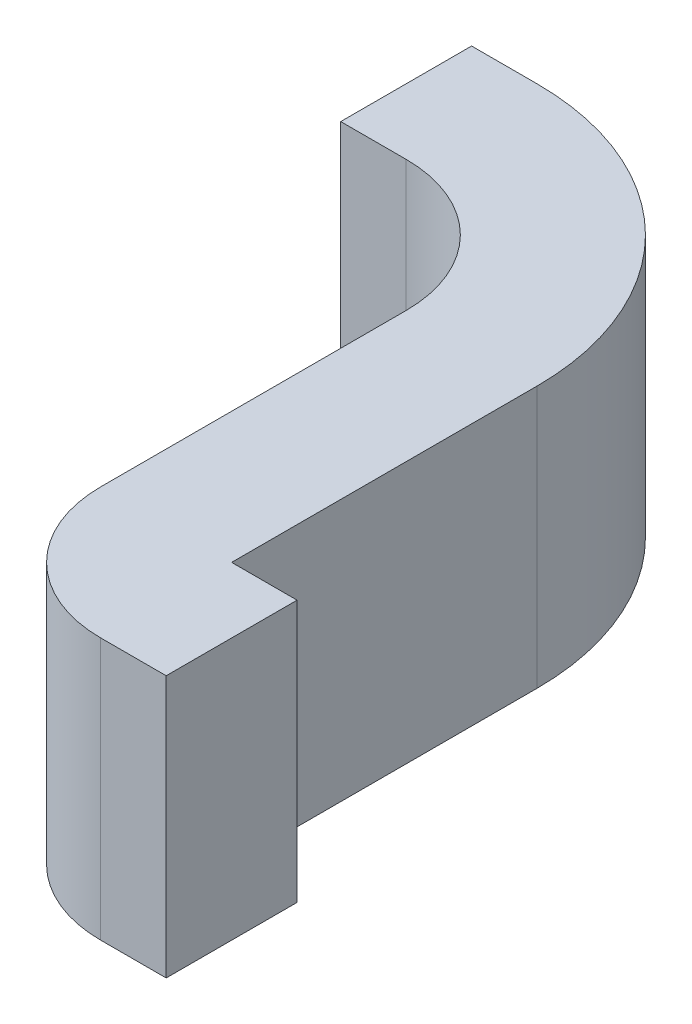
ISO-10303-21;
HEADER;
FILE_DESCRIPTION(('STEP AP214'),'2;1');
FILE_NAME('part.step','',(''),(''),'','','');
FILE_SCHEMA(('AUTOMOTIVE_DESIGN { 1 0 10303 214 1 1 1 1 }'));
ENDSEC;
DATA;
#1=APPLICATION_CONTEXT('core data for automotive mechanical design processes');
#2=APPLICATION_PROTOCOL_DEFINITION('international standard','automotive_design',2000,#1);
#3=PRODUCT_CONTEXT('',#1,'mechanical');
#4=PRODUCT('Part','Part','',(#3));
#5=PRODUCT_RELATED_PRODUCT_CATEGORY('part','',(#4));
#6=PRODUCT_DEFINITION_FORMATION('','',#4);
#7=PRODUCT_DEFINITION_CONTEXT('part definition',#1,'design');
#8=PRODUCT_DEFINITION('design','',#6,#7);
#9=PRODUCT_DEFINITION_SHAPE('','',#8);
#10=(LENGTH_UNIT() NAMED_UNIT(*) SI_UNIT(.MILLI.,.METRE.));
#11=(NAMED_UNIT(*) PLANE_ANGLE_UNIT() SI_UNIT($,.RADIAN.));
#12=(NAMED_UNIT(*) SI_UNIT($,.STERADIAN.) SOLID_ANGLE_UNIT());
#13=UNCERTAINTY_MEASURE_WITH_UNIT(LENGTH_MEASURE(1.E-05),#10,'distance_accuracy_value','');
#14=(GEOMETRIC_REPRESENTATION_CONTEXT(3) GLOBAL_UNCERTAINTY_ASSIGNED_CONTEXT((#13)) GLOBAL_UNIT_ASSIGNED_CONTEXT((#10,
#11,#12)) REPRESENTATION_CONTEXT('',''));
#15=CARTESIAN_POINT('',(0.,0.,0.));
#16=DIRECTION('',(0.,0.,1.));
#17=DIRECTION('',(1.,0.,0.));
#18=AXIS2_PLACEMENT_3D('',#15,#16,#17);
#19=CARTESIAN_POINT('',(-0.925,-0.15,0.65));
#20=DIRECTION('',(0.,1.,0.));
#21=DIRECTION('',(0.,0.,1.));
#22=AXIS2_PLACEMENT_3D('',#19,#20,#21);
#23=PLANE('',#22);
#24=DIRECTION('',(0.,0.,1.));
#25=VECTOR('',#24,1.);
#26=CARTESIAN_POINT('',(-0.85,-0.15,0.65));
#27=LINE('',#26,#25);
#28=CARTESIAN_POINT('',(-0.85,-0.15,0.65));
#29=VERTEX_POINT('',#28);
#30=CARTESIAN_POINT('',(-0.85,-0.15,0.8));
#31=VERTEX_POINT('',#30);
#32=EDGE_CURVE('E11',#29,#31,#27,.T.);
#33=ORIENTED_EDGE('',*,*,#32,.T.);
#34=DIRECTION('',(1.,0.,0.));
#35=VECTOR('',#34,1.);
#36=CARTESIAN_POINT('',(-0.925,-0.15,0.8));
#37=LINE('',#36,#35);
#38=CARTESIAN_POINT('',(-0.925,-0.15,0.8));
#39=VERTEX_POINT('',#38);
#40=EDGE_CURVE('E24',#39,#31,#37,.T.);
#41=ORIENTED_EDGE('',*,*,#40,.F.);
#42=CARTESIAN_POINT('',(-0.925,-0.15,0.65));
#43=DIRECTION('',(0.,-1.,0.));
#44=DIRECTION('',(0.,0.,-1.));
#45=AXIS2_PLACEMENT_3D('',#42,#43,#44);
#46=CIRCLE('',#45,0.15);
#47=CARTESIAN_POINT('',(-1.075,-0.15,0.649999999999999));
#48=VERTEX_POINT('',#47);
#49=EDGE_CURVE('E189',#39,#48,#46,.T.);
#50=ORIENTED_EDGE('',*,*,#49,.T.);
#51=DIRECTION('',(0.,0.,-1.));
#52=VECTOR('',#51,1.);
#53=CARTESIAN_POINT('',(-1.075,-0.15,0.649999999999999));
#54=LINE('',#53,#52);
#55=CARTESIAN_POINT('',(-1.075,-0.15,0.3));
#56=VERTEX_POINT('',#55);
#57=EDGE_CURVE('E187',#48,#56,#54,.T.);
#58=ORIENTED_EDGE('',*,*,#57,.T.);
#59=CARTESIAN_POINT('',(-1.225,-0.15,0.3));
#60=DIRECTION('',(0.,1.,0.));
#61=DIRECTION('',(0.,0.,1.));
#62=AXIS2_PLACEMENT_3D('',#59,#60,#61);
#63=CIRCLE('',#62,0.15);
#64=CARTESIAN_POINT('',(-1.225,-0.15,0.15));
#65=VERTEX_POINT('',#64);
#66=EDGE_CURVE('E185',#56,#65,#63,.T.);
#67=ORIENTED_EDGE('',*,*,#66,.T.);
#68=DIRECTION('',(-1.,0.,0.));
#69=VECTOR('',#68,1.);
#70=CARTESIAN_POINT('',(-1.225,-0.15,0.15));
#71=LINE('',#70,#69);
#72=CARTESIAN_POINT('',(-1.3,-0.15,0.15));
#73=VERTEX_POINT('',#72);
#74=EDGE_CURVE('E102',#65,#73,#71,.T.);
#75=ORIENTED_EDGE('',*,*,#74,.T.);
#76=DIRECTION('',(0.,0.,1.));
#77=VECTOR('',#76,1.);
#78=CARTESIAN_POINT('',(-1.3,-0.15,0.));
#79=LINE('',#78,#77);
#80=CARTESIAN_POINT('',(-1.3,-0.15,0.));
#81=VERTEX_POINT('',#80);
#82=EDGE_CURVE('E181',#81,#73,#79,.T.);
#83=ORIENTED_EDGE('',*,*,#82,.F.);
#84=DIRECTION('',(-1.,0.,0.));
#85=VECTOR('',#84,1.);
#86=CARTESIAN_POINT('',(-1.225,-0.15,0.));
#87=LINE('',#86,#85);
#88=CARTESIAN_POINT('',(-1.225,-0.15,0.));
#89=VERTEX_POINT('',#88);
#90=EDGE_CURVE('E178',#89,#81,#87,.T.);
#91=ORIENTED_EDGE('',*,*,#90,.F.);
#92=CARTESIAN_POINT('',(-1.225,-0.15,0.3));
#93=DIRECTION('',(0.,1.,0.));
#94=DIRECTION('',(0.,0.,1.));
#95=AXIS2_PLACEMENT_3D('',#92,#93,#94);
#96=CIRCLE('',#95,0.299999999999999);
#97=CARTESIAN_POINT('',(-0.925,-0.15,0.3));
#98=VERTEX_POINT('',#97);
#99=EDGE_CURVE('E175',#98,#89,#96,.T.);
#100=ORIENTED_EDGE('',*,*,#99,.F.);
#101=DIRECTION('',(0.,0.,-1.));
#102=VECTOR('',#101,1.);
#103=CARTESIAN_POINT('',(-0.925,-0.15,0.65));
#104=LINE('',#103,#102);
#105=CARTESIAN_POINT('',(-0.925,-0.15,0.65));
#106=VERTEX_POINT('',#105);
#107=EDGE_CURVE('E172',#106,#98,#104,.T.);
#108=ORIENTED_EDGE('',*,*,#107,.F.);
#109=DIRECTION('',(1.,0.,0.));
#110=VECTOR('',#109,1.);
#111=CARTESIAN_POINT('',(-0.925,-0.15,0.65));
#112=LINE('',#111,#110);
#113=EDGE_CURVE('E170',#106,#29,#112,.T.);
#114=ORIENTED_EDGE('',*,*,#113,.T.);
#115=EDGE_LOOP('',(#33,#41,#50,#58,#67,#75,#83,#91,#100,#108,#114));
#116=FACE_BOUND('',#115,.T.);
#117=ADVANCED_FACE('F17',(#116),#23,.F.);
#118=CARTESIAN_POINT('',(-1.3,-0.15,0.));
#119=DIRECTION('',(-1.,0.,0.));
#120=DIRECTION('',(0.,0.,1.));
#121=AXIS2_PLACEMENT_3D('',#118,#119,#120);
#122=PLANE('',#121);
#123=DIRECTION('',(0.,-1.,0.));
#124=VECTOR('',#123,1.);
#125=CARTESIAN_POINT('',(-1.3,0.15,0.));
#126=LINE('',#125,#124);
#127=CARTESIAN_POINT('',(-1.3,0.15,0.));
#128=VERTEX_POINT('',#127);
#129=EDGE_CURVE('E167',#128,#81,#126,.T.);
#130=ORIENTED_EDGE('',*,*,#129,.T.);
#131=ORIENTED_EDGE('',*,*,#82,.T.);
#132=DIRECTION('',(0.,1.,0.));
#133=VECTOR('',#132,1.);
#134=CARTESIAN_POINT('',(-1.3,0.15,0.15));
#135=LINE('',#134,#133);
#136=CARTESIAN_POINT('',(-1.3,0.15,0.15));
#137=VERTEX_POINT('',#136);
#138=EDGE_CURVE('E165',#73,#137,#135,.T.);
#139=ORIENTED_EDGE('',*,*,#138,.T.);
#140=DIRECTION('',(0.,0.,-1.));
#141=VECTOR('',#140,1.);
#142=CARTESIAN_POINT('',(-1.3,0.15,0.));
#143=LINE('',#142,#141);
#144=EDGE_CURVE('E122',#137,#128,#143,.T.);
#145=ORIENTED_EDGE('',*,*,#144,.T.);
#146=EDGE_LOOP('',(#130,#131,#139,#145));
#147=FACE_BOUND('',#146,.T.);
#148=ADVANCED_FACE('F216',(#147),#122,.T.);
#149=CARTESIAN_POINT('',(-1.225,0.,0.3));
#150=DIRECTION('',(0.,1.,0.));
#151=DIRECTION('',(0.,0.,1.));
#152=AXIS2_PLACEMENT_3D('',#149,#150,#151);
#153=CYLINDRICAL_SURFACE('',#152,0.299999999999999);
#154=DIRECTION('',(0.,-1.,0.));
#155=VECTOR('',#154,1.);
#156=CARTESIAN_POINT('',(-0.925,0.15,0.3));
#157=LINE('',#156,#155);
#158=CARTESIAN_POINT('',(-0.925,0.15,0.3));
#159=VERTEX_POINT('',#158);
#160=EDGE_CURVE('E161',#159,#98,#157,.T.);
#161=ORIENTED_EDGE('',*,*,#160,.T.);
#162=ORIENTED_EDGE('',*,*,#99,.T.);
#163=DIRECTION('',(0.,-1.,0.));
#164=VECTOR('',#163,1.);
#165=CARTESIAN_POINT('',(-1.225,0.15,0.));
#166=LINE('',#165,#164);
#167=CARTESIAN_POINT('',(-1.225,0.15,0.));
#168=VERTEX_POINT('',#167);
#169=EDGE_CURVE('E158',#168,#89,#166,.T.);
#170=ORIENTED_EDGE('',*,*,#169,.F.);
#171=CARTESIAN_POINT('',(-1.225,0.15,0.3));
#172=DIRECTION('',(0.,1.,0.));
#173=DIRECTION('',(0.,0.,1.));
#174=AXIS2_PLACEMENT_3D('',#171,#172,#173);
#175=CIRCLE('',#174,0.299999999999999);
#176=EDGE_CURVE('E155',#159,#168,#175,.T.);
#177=ORIENTED_EDGE('',*,*,#176,.F.);
#178=EDGE_LOOP('',(#161,#162,#170,#177));
#179=FACE_BOUND('',#178,.T.);
#180=ADVANCED_FACE('F207',(#179),#153,.T.);
#181=CARTESIAN_POINT('',(-1.075,0.15,0.65));
#182=DIRECTION('',(-1.,0.,0.));
#183=DIRECTION('',(0.,0.,1.));
#184=AXIS2_PLACEMENT_3D('',#181,#182,#183);
#185=PLANE('',#184);
#186=DIRECTION('',(0.,1.,0.));
#187=VECTOR('',#186,1.);
#188=CARTESIAN_POINT('',(-1.075,0.15,0.649999999999999));
#189=LINE('',#188,#187);
#190=CARTESIAN_POINT('',(-1.075,0.15,0.649999999999999));
#191=VERTEX_POINT('',#190);
#192=EDGE_CURVE('E153',#48,#191,#189,.T.);
#193=ORIENTED_EDGE('',*,*,#192,.T.);
#194=DIRECTION('',(0.,0.,-1.));
#195=VECTOR('',#194,1.);
#196=CARTESIAN_POINT('',(-1.075,0.15,0.649999999999999));
#197=LINE('',#196,#195);
#198=CARTESIAN_POINT('',(-1.075,0.15,0.3));
#199=VERTEX_POINT('',#198);
#200=EDGE_CURVE('E151',#191,#199,#197,.T.);
#201=ORIENTED_EDGE('',*,*,#200,.T.);
#202=DIRECTION('',(0.,1.,0.));
#203=VECTOR('',#202,1.);
#204=CARTESIAN_POINT('',(-1.075,0.15,0.3));
#205=LINE('',#204,#203);
#206=EDGE_CURVE('E112',#56,#199,#205,.T.);
#207=ORIENTED_EDGE('',*,*,#206,.F.);
#208=ORIENTED_EDGE('',*,*,#57,.F.);
#209=EDGE_LOOP('',(#193,#201,#207,#208));
#210=FACE_BOUND('',#209,.T.);
#211=ADVANCED_FACE('F204',(#210),#185,.T.);
#212=CARTESIAN_POINT('',(-0.925,0.15,0.65));
#213=DIRECTION('',(0.,0.,1.));
#214=DIRECTION('',(1.,0.,0.));
#215=AXIS2_PLACEMENT_3D('',#212,#213,#214);
#216=PLANE('',#215);
#217=DIRECTION('',(0.,-1.,0.));
#218=VECTOR('',#217,1.);
#219=CARTESIAN_POINT('',(-0.85,0.15,0.65));
#220=LINE('',#219,#218);
#221=CARTESIAN_POINT('',(-0.85,0.15,0.65));
#222=VERTEX_POINT('',#221);
#223=EDGE_CURVE('E147',#222,#29,#220,.T.);
#224=ORIENTED_EDGE('',*,*,#223,.T.);
#225=ORIENTED_EDGE('',*,*,#113,.F.);
#226=DIRECTION('',(0.,-1.,0.));
#227=VECTOR('',#226,1.);
#228=CARTESIAN_POINT('',(-0.925,0.15,0.65));
#229=LINE('',#228,#227);
#230=CARTESIAN_POINT('',(-0.925,0.15,0.65));
#231=VERTEX_POINT('',#230);
#232=EDGE_CURVE('E144',#231,#106,#229,.T.);
#233=ORIENTED_EDGE('',*,*,#232,.F.);
#234=DIRECTION('',(1.,0.,0.));
#235=VECTOR('',#234,1.);
#236=CARTESIAN_POINT('',(-0.925,0.15,0.65));
#237=LINE('',#236,#235);
#238=EDGE_CURVE('E141',#231,#222,#237,.T.);
#239=ORIENTED_EDGE('',*,*,#238,.T.);
#240=EDGE_LOOP('',(#224,#225,#233,#239));
#241=FACE_BOUND('',#240,.T.);
#242=ADVANCED_FACE('F206',(#241),#216,.F.);
#243=CARTESIAN_POINT('',(-0.85,-0.15,0.65));
#244=DIRECTION('',(-1.,0.,0.));
#245=DIRECTION('',(0.,0.,1.));
#246=AXIS2_PLACEMENT_3D('',#243,#244,#245);
#247=PLANE('',#246);
#248=ORIENTED_EDGE('',*,*,#223,.F.);
#249=DIRECTION('',(0.,0.,-1.));
#250=VECTOR('',#249,1.);
#251=CARTESIAN_POINT('',(-0.85,0.15,0.65));
#252=LINE('',#251,#250);
#253=CARTESIAN_POINT('',(-0.85,0.15,0.8));
#254=VERTEX_POINT('',#253);
#255=EDGE_CURVE('E139',#254,#222,#252,.T.);
#256=ORIENTED_EDGE('',*,*,#255,.F.);
#257=DIRECTION('',(0.,1.,0.));
#258=VECTOR('',#257,1.);
#259=CARTESIAN_POINT('',(-0.85,0.15,0.8));
#260=LINE('',#259,#258);
#261=EDGE_CURVE('E136',#31,#254,#260,.T.);
#262=ORIENTED_EDGE('',*,*,#261,.F.);
#263=ORIENTED_EDGE('',*,*,#32,.F.);
#264=EDGE_LOOP('',(#248,#256,#262,#263));
#265=FACE_BOUND('',#264,.T.);
#266=ADVANCED_FACE('F195',(#265),#247,.F.);
#267=CARTESIAN_POINT('',(-0.925,0.,0.65));
#268=DIRECTION('',(0.,-1.,0.));
#269=DIRECTION('',(0.,0.,-1.));
#270=AXIS2_PLACEMENT_3D('',#267,#268,#269);
#271=CYLINDRICAL_SURFACE('',#270,0.15);
#272=DIRECTION('',(0.,1.,0.));
#273=VECTOR('',#272,1.);
#274=CARTESIAN_POINT('',(-0.925,0.15,0.8));
#275=LINE('',#274,#273);
#276=CARTESIAN_POINT('',(-0.925,0.15,0.8));
#277=VERTEX_POINT('',#276);
#278=EDGE_CURVE('E134',#39,#277,#275,.T.);
#279=ORIENTED_EDGE('',*,*,#278,.T.);
#280=CARTESIAN_POINT('',(-0.925,0.15,0.65));
#281=DIRECTION('',(0.,-1.,0.));
#282=DIRECTION('',(0.,0.,-1.));
#283=AXIS2_PLACEMENT_3D('',#280,#281,#282);
#284=CIRCLE('',#283,0.15);
#285=EDGE_CURVE('E131',#277,#191,#284,.T.);
#286=ORIENTED_EDGE('',*,*,#285,.T.);
#287=ORIENTED_EDGE('',*,*,#192,.F.);
#288=ORIENTED_EDGE('',*,*,#49,.F.);
#289=EDGE_LOOP('',(#279,#286,#287,#288));
#290=FACE_BOUND('',#289,.T.);
#291=ADVANCED_FACE('F201',(#290),#271,.T.);
#292=CARTESIAN_POINT('',(-0.925,0.15,0.8));
#293=DIRECTION('',(0.,0.,-1.));
#294=DIRECTION('',(-1.,0.,0.));
#295=AXIS2_PLACEMENT_3D('',#292,#293,#294);
#296=PLANE('',#295);
#297=ORIENTED_EDGE('',*,*,#261,.T.);
#298=DIRECTION('',(1.,0.,0.));
#299=VECTOR('',#298,1.);
#300=CARTESIAN_POINT('',(-0.925,0.15,0.8));
#301=LINE('',#300,#299);
#302=EDGE_CURVE('E115',#277,#254,#301,.T.);
#303=ORIENTED_EDGE('',*,*,#302,.F.);
#304=ORIENTED_EDGE('',*,*,#278,.F.);
#305=ORIENTED_EDGE('',*,*,#40,.T.);
#306=EDGE_LOOP('',(#297,#303,#304,#305));
#307=FACE_BOUND('',#306,.T.);
#308=ADVANCED_FACE('F192',(#307),#296,.F.);
#309=CARTESIAN_POINT('',(-1.225,0.,0.3));
#310=DIRECTION('',(0.,1.,0.));
#311=DIRECTION('',(0.,0.,1.));
#312=AXIS2_PLACEMENT_3D('',#309,#310,#311);
#313=CYLINDRICAL_SURFACE('',#312,0.15);
#314=ORIENTED_EDGE('',*,*,#206,.T.);
#315=CARTESIAN_POINT('',(-1.225,0.15,0.3));
#316=DIRECTION('',(0.,1.,0.));
#317=DIRECTION('',(0.,0.,1.));
#318=AXIS2_PLACEMENT_3D('',#315,#316,#317);
#319=CIRCLE('',#318,0.15);
#320=CARTESIAN_POINT('',(-1.225,0.15,0.15));
#321=VERTEX_POINT('',#320);
#322=EDGE_CURVE('E105',#199,#321,#319,.T.);
#323=ORIENTED_EDGE('',*,*,#322,.T.);
#324=DIRECTION('',(0.,1.,0.));
#325=VECTOR('',#324,1.);
#326=CARTESIAN_POINT('',(-1.225,0.15,0.15));
#327=LINE('',#326,#325);
#328=EDGE_CURVE('E96',#65,#321,#327,.T.);
#329=ORIENTED_EDGE('',*,*,#328,.F.);
#330=ORIENTED_EDGE('',*,*,#66,.F.);
#331=EDGE_LOOP('',(#314,#323,#329,#330));
#332=FACE_BOUND('',#331,.T.);
#333=ADVANCED_FACE('F110',(#332),#313,.F.);
#334=CARTESIAN_POINT('',(-0.925,0.15,0.65));
#335=DIRECTION('',(1.,0.,0.));
#336=DIRECTION('',(0.,0.,-1.));
#337=AXIS2_PLACEMENT_3D('',#334,#335,#336);
#338=PLANE('',#337);
#339=ORIENTED_EDGE('',*,*,#232,.T.);
#340=ORIENTED_EDGE('',*,*,#107,.T.);
#341=ORIENTED_EDGE('',*,*,#160,.F.);
#342=DIRECTION('',(0.,0.,-1.));
#343=VECTOR('',#342,1.);
#344=CARTESIAN_POINT('',(-0.925,0.15,0.65));
#345=LINE('',#344,#343);
#346=EDGE_CURVE('E106',#231,#159,#345,.T.);
#347=ORIENTED_EDGE('',*,*,#346,.F.);
#348=EDGE_LOOP('',(#339,#340,#341,#347));
#349=FACE_BOUND('',#348,.T.);
#350=ADVANCED_FACE('F231',(#349),#338,.T.);
#351=CARTESIAN_POINT('',(-1.225,0.15,0.15));
#352=DIRECTION('',(0.,0.,1.));
#353=DIRECTION('',(1.,0.,0.));
#354=AXIS2_PLACEMENT_3D('',#351,#352,#353);
#355=PLANE('',#354);
#356=ORIENTED_EDGE('',*,*,#328,.T.);
#357=DIRECTION('',(-1.,0.,0.));
#358=VECTOR('',#357,1.);
#359=CARTESIAN_POINT('',(-1.225,0.15,0.15));
#360=LINE('',#359,#358);
#361=EDGE_CURVE('E101',#321,#137,#360,.T.);
#362=ORIENTED_EDGE('',*,*,#361,.T.);
#363=ORIENTED_EDGE('',*,*,#138,.F.);
#364=ORIENTED_EDGE('',*,*,#74,.F.);
#365=EDGE_LOOP('',(#356,#362,#363,#364));
#366=FACE_BOUND('',#365,.T.);
#367=ADVANCED_FACE('F98',(#366),#355,.T.);
#368=CARTESIAN_POINT('',(-1.225,0.15,0.));
#369=DIRECTION('',(0.,0.,-1.));
#370=DIRECTION('',(-1.,0.,0.));
#371=AXIS2_PLACEMENT_3D('',#368,#369,#370);
#372=PLANE('',#371);
#373=ORIENTED_EDGE('',*,*,#169,.T.);
#374=ORIENTED_EDGE('',*,*,#90,.T.);
#375=ORIENTED_EDGE('',*,*,#129,.F.);
#376=DIRECTION('',(-1.,0.,0.));
#377=VECTOR('',#376,1.);
#378=CARTESIAN_POINT('',(-1.225,0.15,0.));
#379=LINE('',#378,#377);
#380=EDGE_CURVE('E123',#168,#128,#379,.T.);
#381=ORIENTED_EDGE('',*,*,#380,.F.);
#382=EDGE_LOOP('',(#373,#374,#375,#381));
#383=FACE_BOUND('',#382,.T.);
#384=ADVANCED_FACE('F228',(#383),#372,.T.);
#385=CARTESIAN_POINT('',(-0.925,0.15,0.65));
#386=DIRECTION('',(0.,-1.,0.));
#387=DIRECTION('',(0.,0.,-1.));
#388=AXIS2_PLACEMENT_3D('',#385,#386,#387);
#389=PLANE('',#388);
#390=ORIENTED_EDGE('',*,*,#255,.T.);
#391=ORIENTED_EDGE('',*,*,#238,.F.);
#392=ORIENTED_EDGE('',*,*,#346,.T.);
#393=ORIENTED_EDGE('',*,*,#176,.T.);
#394=ORIENTED_EDGE('',*,*,#380,.T.);
#395=ORIENTED_EDGE('',*,*,#144,.F.);
#396=ORIENTED_EDGE('',*,*,#361,.F.);
#397=ORIENTED_EDGE('',*,*,#322,.F.);
#398=ORIENTED_EDGE('',*,*,#200,.F.);
#399=ORIENTED_EDGE('',*,*,#285,.F.);
#400=ORIENTED_EDGE('',*,*,#302,.T.);
#401=EDGE_LOOP('',(#390,#391,#392,#393,#394,#395,#396,#397,#398,#399,#400));
#402=FACE_BOUND('',#401,.T.);
#403=ADVANCED_FACE('F119',(#402),#389,.F.);
#404=CLOSED_SHELL('',(#117,#148,#180,#211,#242,#266,#291,#308,#333,#350,#367,#384,#403));
#405=MANIFOLD_SOLID_BREP('B1',#404);
#406=ADVANCED_BREP_SHAPE_REPRESENTATION('',(#18,#405),#14);
#407=SHAPE_DEFINITION_REPRESENTATION(#9,#406);
ENDSEC;
END-ISO-10303-21;
